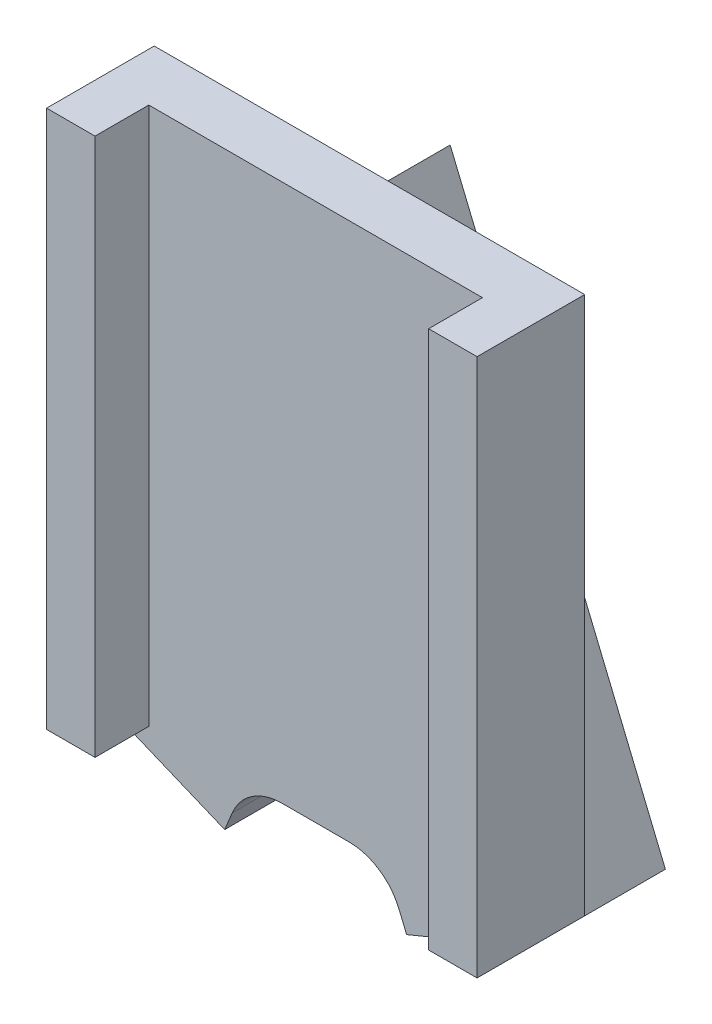
ISO-10303-21;
HEADER;
FILE_DESCRIPTION(('STEP AP214'),'2;1');
FILE_NAME('part.step','',(''),(''),'','','');
FILE_SCHEMA(('AUTOMOTIVE_DESIGN { 1 0 10303 214 1 1 1 1 }'));
ENDSEC;
DATA;
#1=APPLICATION_CONTEXT('core data for automotive mechanical design processes');
#2=APPLICATION_PROTOCOL_DEFINITION('international standard','automotive_design',2000,#1);
#3=PRODUCT_CONTEXT('',#1,'mechanical');
#4=PRODUCT('Part','Part','',(#3));
#5=PRODUCT_RELATED_PRODUCT_CATEGORY('part','',(#4));
#6=PRODUCT_DEFINITION_FORMATION('','',#4);
#7=PRODUCT_DEFINITION_CONTEXT('part definition',#1,'design');
#8=PRODUCT_DEFINITION('design','',#6,#7);
#9=PRODUCT_DEFINITION_SHAPE('','',#8);
#10=(LENGTH_UNIT() NAMED_UNIT(*) SI_UNIT(.MILLI.,.METRE.));
#11=(NAMED_UNIT(*) PLANE_ANGLE_UNIT() SI_UNIT($,.RADIAN.));
#12=(NAMED_UNIT(*) SI_UNIT($,.STERADIAN.) SOLID_ANGLE_UNIT());
#13=UNCERTAINTY_MEASURE_WITH_UNIT(LENGTH_MEASURE(1.E-05),#10,'distance_accuracy_value','');
#14=(GEOMETRIC_REPRESENTATION_CONTEXT(3) GLOBAL_UNCERTAINTY_ASSIGNED_CONTEXT((#13)) GLOBAL_UNIT_ASSIGNED_CONTEXT((#10,
#11,#12)) REPRESENTATION_CONTEXT('',''));
#15=CARTESIAN_POINT('',(0.,0.,0.));
#16=DIRECTION('',(0.,0.,1.));
#17=DIRECTION('',(1.,0.,0.));
#18=AXIS2_PLACEMENT_3D('',#15,#16,#17);
#19=CARTESIAN_POINT('',(2.30969883127822,-10.9567085809127,1.));
#20=DIRECTION('',(0.923879532511288,-0.382683432365087,0.));
#21=DIRECTION('',(0.382683432365087,0.923879532511288,0.));
#22=AXIS2_PLACEMENT_3D('',#19,#20,#21);
#23=PLANE('',#22);
#24=DIRECTION('',(0.382683432365087,0.923879532511288,0.));
#25=VECTOR('',#24,1.);
#26=CARTESIAN_POINT('',(5.84523273721094,-2.42117467497996,0.));
#27=LINE('',#26,#25);
#28=CARTESIAN_POINT('',(2.450279606139,-10.6173165676349,0.));
#29=VERTEX_POINT('',#28);
#30=CARTESIAN_POINT('',(3.71016818448233,-7.57567647471944,0.));
#31=VERTEX_POINT('',#30);
#32=EDGE_CURVE('E207',#29,#31,#27,.T.);
#33=ORIENTED_EDGE('',*,*,#32,.F.);
#34=DIRECTION('',(0.,0.,-1.));
#35=VECTOR('',#34,1.);
#36=CARTESIAN_POINT('',(2.450279606139,-10.6173165676349,1.));
#37=LINE('',#36,#35);
#38=CARTESIAN_POINT('',(2.450279606139,-10.6173165676349,1.));
#39=VERTEX_POINT('',#38);
#40=EDGE_CURVE('E296',#29,#39,#37,.F.);
#41=ORIENTED_EDGE('',*,*,#40,.T.);
#42=DIRECTION('',(-0.382683432365087,-0.923879532511288,0.));
#43=VECTOR('',#42,1.);
#44=CARTESIAN_POINT('',(2.30969883127822,-10.9567085809127,1.));
#45=LINE('',#44,#43);
#46=CARTESIAN_POINT('',(2.30969883127822,-10.9567085809127,1.));
#47=VERTEX_POINT('',#46);
#48=EDGE_CURVE('E308',#39,#47,#45,.T.);
#49=ORIENTED_EDGE('',*,*,#48,.T.);
#50=DIRECTION('',(0.,0.,-1.));
#51=VECTOR('',#50,1.);
#52=CARTESIAN_POINT('',(2.30969883127822,-10.9567085809127,1.));
#53=LINE('',#52,#51);
#54=CARTESIAN_POINT('',(2.30969883127822,-10.9567085809127,-1.5));
#55=VERTEX_POINT('',#54);
#56=EDGE_CURVE('E348',#47,#55,#53,.T.);
#57=ORIENTED_EDGE('',*,*,#56,.T.);
#58=DIRECTION('',(-0.382683432365087,-0.923879532511288,0.));
#59=VECTOR('',#58,1.);
#60=CARTESIAN_POINT('',(2.30969883127822,-10.9567085809127,-1.5));
#61=LINE('',#60,#59);
#62=CARTESIAN_POINT('',(3.71016818448233,-7.57567647471944,-1.5));
#63=VERTEX_POINT('',#62);
#64=EDGE_CURVE('E361',#63,#55,#61,.T.);
#65=ORIENTED_EDGE('',*,*,#64,.F.);
#66=DIRECTION('',(0.,0.,-1.));
#67=VECTOR('',#66,1.);
#68=CARTESIAN_POINT('',(3.71016818448233,-7.57567647471944,0.));
#69=LINE('',#68,#67);
#70=EDGE_CURVE('E198',#31,#63,#69,.T.);
#71=ORIENTED_EDGE('',*,*,#70,.F.);
#72=EDGE_LOOP('',(#33,#41,#49,#57,#65,#71));
#73=FACE_BOUND('',#72,.T.);
#74=ADVANCED_FACE('F33',(#73),#23,.T.);
#75=CARTESIAN_POINT('',(3.99999999999999,-6.8759605748895,1.));
#76=DIRECTION('',(-0.923879532511288,-0.382683432365088,0.));
#77=DIRECTION('',(0.382683432365088,-0.923879532511288,0.));
#78=AXIS2_PLACEMENT_3D('',#75,#76,#77);
#79=PLANE('',#78);
#80=DIRECTION('',(0.,0.,-1.));
#81=VECTOR('',#80,1.);
#82=CARTESIAN_POINT('',(4.01000933746841,-6.90012525315614,0.));
#83=LINE('',#82,#81);
#84=CARTESIAN_POINT('',(4.01000933746841,-6.90012525315614,0.));
#85=VERTEX_POINT('',#84);
#86=CARTESIAN_POINT('',(4.01000933746841,-6.90012525315614,-1.5));
#87=VERTEX_POINT('',#86);
#88=EDGE_CURVE('E199',#85,#87,#83,.T.);
#89=ORIENTED_EDGE('',*,*,#88,.F.);
#90=DIRECTION('',(0.382683432365088,-0.923879532511288,0.));
#91=VECTOR('',#90,1.);
#92=CARTESIAN_POINT('',(0.983194387535245,0.407252449766205,0.));
#93=LINE('',#92,#91);
#94=CARTESIAN_POINT('',(3.99999999999999,-6.8759605748895,0.));
#95=VERTEX_POINT('',#94);
#96=EDGE_CURVE('E214',#95,#85,#93,.T.);
#97=ORIENTED_EDGE('',*,*,#96,.F.);
#98=DIRECTION('',(0.,0.,-1.));
#99=VECTOR('',#98,1.);
#100=CARTESIAN_POINT('',(3.99999999999999,-6.8759605748895,1.));
#101=LINE('',#100,#99);
#102=CARTESIAN_POINT('',(3.99999999999999,-6.8759605748895,-1.5));
#103=VERTEX_POINT('',#102);
#104=EDGE_CURVE('E213',#95,#103,#101,.T.);
#105=ORIENTED_EDGE('',*,*,#104,.T.);
#106=DIRECTION('',(-0.382683432365088,0.923879532511288,0.));
#107=VECTOR('',#106,1.);
#108=CARTESIAN_POINT('',(3.99999999999999,-6.8759605748895,-1.5));
#109=LINE('',#108,#107);
#110=EDGE_CURVE('E362',#87,#103,#109,.T.);
#111=ORIENTED_EDGE('',*,*,#110,.F.);
#112=EDGE_LOOP('',(#89,#97,#105,#111));
#113=FACE_BOUND('',#112,.T.);
#114=ADVANCED_FACE('F437',(#113),#79,.T.);
#115=CARTESIAN_POINT('',(0.,-10.,2.));
#116=DIRECTION('',(0.,1.,0.));
#117=DIRECTION('',(0.,0.,1.));
#118=AXIS2_PLACEMENT_3D('',#115,#116,#117);
#119=PLANE('',#118);
#120=DIRECTION('',(1.,0.,0.));
#121=VECTOR('',#120,1.);
#122=CARTESIAN_POINT('',(0.900000000000001,-10.,1.));
#123=LINE('',#122,#121);
#124=CARTESIAN_POINT('',(3.37415913865028,-10.,1.));
#125=VERTEX_POINT('',#124);
#126=CARTESIAN_POINT('',(4.6258408613497,-10.,1.));
#127=VERTEX_POINT('',#126);
#128=EDGE_CURVE('E231',#125,#127,#123,.T.);
#129=ORIENTED_EDGE('',*,*,#128,.F.);
#130=DIRECTION('',(0.,0.,-1.));
#131=VECTOR('',#130,1.);
#132=CARTESIAN_POINT('',(3.37415913865028,-10.,2.));
#133=LINE('',#132,#131);
#134=CARTESIAN_POINT('',(3.37415913865028,-10.,0.));
#135=VERTEX_POINT('',#134);
#136=EDGE_CURVE('E293',#125,#135,#133,.T.);
#137=ORIENTED_EDGE('',*,*,#136,.T.);
#138=DIRECTION('',(1.,0.,0.));
#139=VECTOR('',#138,1.);
#140=CARTESIAN_POINT('',(0.,-10.,0.));
#141=LINE('',#140,#139);
#142=CARTESIAN_POINT('',(4.6258408613497,-10.,0.));
#143=VERTEX_POINT('',#142);
#144=EDGE_CURVE('E270',#135,#143,#141,.T.);
#145=ORIENTED_EDGE('',*,*,#144,.T.);
#146=DIRECTION('',(0.,0.,1.));
#147=VECTOR('',#146,1.);
#148=CARTESIAN_POINT('',(4.6258408613497,-10.,2.));
#149=LINE('',#148,#147);
#150=EDGE_CURVE('E290',#143,#127,#149,.T.);
#151=ORIENTED_EDGE('',*,*,#150,.T.);
#152=EDGE_LOOP('',(#129,#137,#145,#151));
#153=FACE_BOUND('',#152,.T.);
#154=ADVANCED_FACE('F313',(#153),#119,.F.);
#155=DIRECTION('',(0.,0.,-1.));
#156=VECTOR('',#155,1.);
#157=CARTESIAN_POINT('',(0.,-10.,2.));
#158=LINE('',#157,#156);
#159=CARTESIAN_POINT('',(0.,-10.,2.));
#160=VERTEX_POINT('',#159);
#161=CARTESIAN_POINT('',(0.,-10.,1.));
#162=VERTEX_POINT('',#161);
#163=EDGE_CURVE('E284',#160,#162,#158,.T.);
#164=ORIENTED_EDGE('',*,*,#163,.T.);
#165=DIRECTION('',(1.,0.,0.));
#166=VECTOR('',#165,1.);
#167=CARTESIAN_POINT('',(0.,-10.,1.));
#168=LINE('',#167,#166);
#169=CARTESIAN_POINT('',(0.900000000000001,-10.,1.));
#170=VERTEX_POINT('',#169);
#171=EDGE_CURVE('E228',#162,#170,#168,.T.);
#172=ORIENTED_EDGE('',*,*,#171,.T.);
#173=DIRECTION('',(0.,0.,1.));
#174=VECTOR('',#173,1.);
#175=CARTESIAN_POINT('',(0.900000000000001,-10.,1.));
#176=LINE('',#175,#174);
#177=CARTESIAN_POINT('',(0.900000000000001,-10.,2.));
#178=VERTEX_POINT('',#177);
#179=EDGE_CURVE('E239',#170,#178,#176,.T.);
#180=ORIENTED_EDGE('',*,*,#179,.T.);
#181=DIRECTION('',(1.,0.,0.));
#182=VECTOR('',#181,1.);
#183=CARTESIAN_POINT('',(0.,-10.,2.));
#184=LINE('',#183,#182);
#185=EDGE_CURVE('E258',#160,#178,#184,.T.);
#186=ORIENTED_EDGE('',*,*,#185,.F.);
#187=EDGE_LOOP('',(#164,#172,#180,#186));
#188=FACE_BOUND('',#187,.T.);
#189=ADVANCED_FACE('F429',(#188),#119,.F.);
#190=CARTESIAN_POINT('',(0.,0.,0.));
#191=DIRECTION('',(0.,0.,1.));
#192=DIRECTION('',(1.,0.,0.));
#193=AXIS2_PLACEMENT_3D('',#190,#191,#192);
#194=PLANE('',#193);
#195=DIRECTION('',(0.,1.,0.));
#196=VECTOR('',#195,1.);
#197=CARTESIAN_POINT('',(7.99999999999998,0.,0.));
#198=LINE('',#197,#196);
#199=CARTESIAN_POINT('',(7.99999999999998,-10.,0.));
#200=VERTEX_POINT('',#199);
#201=CARTESIAN_POINT('',(7.99999999999998,0.,0.));
#202=VERTEX_POINT('',#201);
#203=EDGE_CURVE('E273',#200,#202,#198,.T.);
#204=ORIENTED_EDGE('',*,*,#203,.F.);
#205=DIRECTION('',(-0.382683432365088,0.923879532511288,0.));
#206=VECTOR('',#205,1.);
#207=CARTESIAN_POINT('',(3.29289321881346,1.36396103067892,0.));
#208=LINE('',#207,#206);
#209=CARTESIAN_POINT('',(3.99999999999999,-0.343145750507577,0.));
#210=VERTEX_POINT('',#209);
#211=EDGE_CURVE('E222',#200,#210,#208,.T.);
#212=ORIENTED_EDGE('',*,*,#211,.T.);
#213=DIRECTION('',(-0.382683432365087,-0.923879532511288,0.));
#214=VECTOR('',#213,1.);
#215=CARTESIAN_POINT('',(3.53553390593272,-1.46446609406724,0.));
#216=LINE('',#215,#214);
#217=CARTESIAN_POINT('',(0.,-10.,0.));
#218=VERTEX_POINT('',#217);
#219=EDGE_CURVE('E216',#210,#218,#216,.T.);
#220=ORIENTED_EDGE('',*,*,#219,.T.);
#221=DIRECTION('',(0.,-1.,0.));
#222=VECTOR('',#221,1.);
#223=CARTESIAN_POINT('',(0.,0.,0.));
#224=LINE('',#223,#222);
#225=CARTESIAN_POINT('',(0.,0.,0.));
#226=VERTEX_POINT('',#225);
#227=EDGE_CURVE('E245',#226,#218,#224,.T.);
#228=ORIENTED_EDGE('',*,*,#227,.F.);
#229=DIRECTION('',(-1.,0.,0.));
#230=VECTOR('',#229,1.);
#231=CARTESIAN_POINT('',(0.,0.,0.));
#232=LINE('',#231,#230);
#233=EDGE_CURVE('E257',#202,#226,#232,.T.);
#234=ORIENTED_EDGE('',*,*,#233,.F.);
#235=EDGE_LOOP('',(#204,#212,#220,#228,#234));
#236=FACE_BOUND('',#235,.T.);
#237=ADVANCED_FACE('F395',(#236),#194,.F.);
#238=CARTESIAN_POINT('',(0.,0.,2.));
#239=DIRECTION('',(0.,0.,1.));
#240=DIRECTION('',(1.,0.,0.));
#241=AXIS2_PLACEMENT_3D('',#238,#239,#240);
#242=PLANE('',#241);
#243=DIRECTION('',(0.,-1.,0.));
#244=VECTOR('',#243,1.);
#245=CARTESIAN_POINT('',(0.9,0.,2.));
#246=LINE('',#245,#244);
#247=CARTESIAN_POINT('',(0.9,0.,2.));
#248=VERTEX_POINT('',#247);
#249=EDGE_CURVE('E240',#248,#178,#246,.T.);
#250=ORIENTED_EDGE('',*,*,#249,.F.);
#251=DIRECTION('',(-1.,0.,0.));
#252=VECTOR('',#251,1.);
#253=CARTESIAN_POINT('',(0.,0.,2.));
#254=LINE('',#253,#252);
#255=CARTESIAN_POINT('',(0.,0.,2.));
#256=VERTEX_POINT('',#255);
#257=EDGE_CURVE('E263',#248,#256,#254,.T.);
#258=ORIENTED_EDGE('',*,*,#257,.T.);
#259=DIRECTION('',(0.,-1.,0.));
#260=VECTOR('',#259,1.);
#261=CARTESIAN_POINT('',(0.,0.,2.));
#262=LINE('',#261,#260);
#263=EDGE_CURVE('E253',#256,#160,#262,.T.);
#264=ORIENTED_EDGE('',*,*,#263,.T.);
#265=ORIENTED_EDGE('',*,*,#185,.T.);
#266=EDGE_LOOP('',(#250,#258,#264,#265));
#267=FACE_BOUND('',#266,.T.);
#268=ADVANCED_FACE('F409',(#267),#242,.T.);
#269=CARTESIAN_POINT('',(0.,0.,2.));
#270=DIRECTION('',(1.,0.,0.));
#271=DIRECTION('',(0.,1.,0.));
#272=AXIS2_PLACEMENT_3D('',#269,#270,#271);
#273=PLANE('',#272);
#274=ORIENTED_EDGE('',*,*,#227,.T.);
#275=DIRECTION('',(0.,0.,-1.));
#276=VECTOR('',#275,1.);
#277=CARTESIAN_POINT('',(0.,-10.,1.));
#278=LINE('',#277,#276);
#279=EDGE_CURVE('E344',#162,#218,#278,.T.);
#280=ORIENTED_EDGE('',*,*,#279,.F.);
#281=ORIENTED_EDGE('',*,*,#163,.F.);
#282=ORIENTED_EDGE('',*,*,#263,.F.);
#283=DIRECTION('',(0.,0.,-1.));
#284=VECTOR('',#283,1.);
#285=CARTESIAN_POINT('',(0.,0.,2.));
#286=LINE('',#285,#284);
#287=EDGE_CURVE('E267',#256,#226,#286,.T.);
#288=ORIENTED_EDGE('',*,*,#287,.T.);
#289=EDGE_LOOP('',(#274,#280,#281,#282,#288));
#290=FACE_BOUND('',#289,.T.);
#291=ADVANCED_FACE('F404',(#290),#273,.F.);
#292=DIRECTION('',(0.,0.,1.));
#293=VECTOR('',#292,1.);
#294=CARTESIAN_POINT('',(7.09999999999998,-10.,1.));
#295=LINE('',#294,#293);
#296=CARTESIAN_POINT('',(7.09999999999998,-10.,1.));
#297=VERTEX_POINT('',#296);
#298=CARTESIAN_POINT('',(7.09999999999998,-10.,2.));
#299=VERTEX_POINT('',#298);
#300=EDGE_CURVE('E249',#297,#299,#295,.T.);
#301=ORIENTED_EDGE('',*,*,#300,.F.);
#302=CARTESIAN_POINT('',(7.99999999999998,-10.,1.));
#303=VERTEX_POINT('',#302);
#304=EDGE_CURVE('E225',#297,#303,#168,.T.);
#305=ORIENTED_EDGE('',*,*,#304,.T.);
#306=DIRECTION('',(0.,0.,-1.));
#307=VECTOR('',#306,1.);
#308=CARTESIAN_POINT('',(7.99999999999998,-10.,2.));
#309=LINE('',#308,#307);
#310=CARTESIAN_POINT('',(7.99999999999998,-10.,2.));
#311=VERTEX_POINT('',#310);
#312=EDGE_CURVE('E281',#311,#303,#309,.T.);
#313=ORIENTED_EDGE('',*,*,#312,.F.);
#314=EDGE_CURVE('E256',#299,#311,#184,.T.);
#315=ORIENTED_EDGE('',*,*,#314,.F.);
#316=EDGE_LOOP('',(#301,#305,#313,#315));
#317=FACE_BOUND('',#316,.T.);
#318=ADVANCED_FACE('F426',(#317),#119,.F.);
#319=CARTESIAN_POINT('',(7.99999999999998,0.,2.));
#320=DIRECTION('',(-1.,0.,0.));
#321=DIRECTION('',(0.,-1.,0.));
#322=AXIS2_PLACEMENT_3D('',#319,#320,#321);
#323=PLANE('',#322);
#324=ORIENTED_EDGE('',*,*,#203,.T.);
#325=DIRECTION('',(0.,0.,-1.));
#326=VECTOR('',#325,1.);
#327=CARTESIAN_POINT('',(7.99999999999998,0.,2.));
#328=LINE('',#327,#326);
#329=CARTESIAN_POINT('',(7.99999999999998,0.,2.));
#330=VERTEX_POINT('',#329);
#331=EDGE_CURVE('E278',#330,#202,#328,.T.);
#332=ORIENTED_EDGE('',*,*,#331,.F.);
#333=DIRECTION('',(0.,1.,0.));
#334=VECTOR('',#333,1.);
#335=CARTESIAN_POINT('',(7.99999999999998,0.,2.));
#336=LINE('',#335,#334);
#337=EDGE_CURVE('E261',#311,#330,#336,.T.);
#338=ORIENTED_EDGE('',*,*,#337,.F.);
#339=ORIENTED_EDGE('',*,*,#312,.T.);
#340=DIRECTION('',(0.,0.,-1.));
#341=VECTOR('',#340,1.);
#342=CARTESIAN_POINT('',(7.99999999999998,-10.,1.));
#343=LINE('',#342,#341);
#344=EDGE_CURVE('E338',#303,#200,#343,.T.);
#345=ORIENTED_EDGE('',*,*,#344,.T.);
#346=EDGE_LOOP('',(#324,#332,#338,#339,#345));
#347=FACE_BOUND('',#346,.T.);
#348=ADVANCED_FACE('F389',(#347),#323,.F.);
#349=CARTESIAN_POINT('',(0.,0.,2.));
#350=DIRECTION('',(0.,-1.,0.));
#351=DIRECTION('',(0.,0.,-1.));
#352=AXIS2_PLACEMENT_3D('',#349,#350,#351);
#353=PLANE('',#352);
#354=ORIENTED_EDGE('',*,*,#257,.F.);
#355=DIRECTION('',(0.,0.,1.));
#356=VECTOR('',#355,1.);
#357=CARTESIAN_POINT('',(0.9,0.,1.));
#358=LINE('',#357,#356);
#359=CARTESIAN_POINT('',(0.9,0.,1.));
#360=VERTEX_POINT('',#359);
#361=EDGE_CURVE('E243',#360,#248,#358,.T.);
#362=ORIENTED_EDGE('',*,*,#361,.F.);
#363=DIRECTION('',(-1.,0.,0.));
#364=VECTOR('',#363,1.);
#365=CARTESIAN_POINT('',(0.9,0.,1.));
#366=LINE('',#365,#364);
#367=CARTESIAN_POINT('',(7.09999999999998,0.,1.));
#368=VERTEX_POINT('',#367);
#369=EDGE_CURVE('E236',#368,#360,#366,.T.);
#370=ORIENTED_EDGE('',*,*,#369,.F.);
#371=DIRECTION('',(0.,0.,1.));
#372=VECTOR('',#371,1.);
#373=CARTESIAN_POINT('',(7.09999999999998,0.,1.));
#374=LINE('',#373,#372);
#375=CARTESIAN_POINT('',(7.09999999999998,0.,2.));
#376=VERTEX_POINT('',#375);
#377=EDGE_CURVE('E246',#368,#376,#374,.T.);
#378=ORIENTED_EDGE('',*,*,#377,.T.);
#379=EDGE_CURVE('E264',#330,#376,#254,.T.);
#380=ORIENTED_EDGE('',*,*,#379,.F.);
#381=ORIENTED_EDGE('',*,*,#331,.T.);
#382=ORIENTED_EDGE('',*,*,#233,.T.);
#383=ORIENTED_EDGE('',*,*,#287,.F.);
#384=EDGE_LOOP('',(#354,#362,#370,#378,#380,#381,#382,#383));
#385=FACE_BOUND('',#384,.T.);
#386=ADVANCED_FACE('F400',(#385),#353,.F.);
#387=DIRECTION('',(0.,1.,0.));
#388=VECTOR('',#387,1.);
#389=CARTESIAN_POINT('',(7.09999999999998,0.,2.));
#390=LINE('',#389,#388);
#391=EDGE_CURVE('E232',#299,#376,#390,.T.);
#392=ORIENTED_EDGE('',*,*,#391,.F.);
#393=ORIENTED_EDGE('',*,*,#314,.T.);
#394=ORIENTED_EDGE('',*,*,#337,.T.);
#395=ORIENTED_EDGE('',*,*,#379,.T.);
#396=EDGE_LOOP('',(#392,#393,#394,#395));
#397=FACE_BOUND('',#396,.T.);
#398=ADVANCED_FACE('F423',(#397),#242,.T.);
#399=ORIENTED_EDGE('',*,*,#32,.T.);
#400=CARTESIAN_POINT('',(3.99999999999999,-7.3,0.));
#401=DIRECTION('',(0.,0.,-1.));
#402=DIRECTION('',(-1.,0.,0.));
#403=AXIS2_PLACEMENT_3D('',#400,#401,#402);
#404=CIRCLE('',#403,0.4);
#405=CARTESIAN_POINT('',(3.98999066253156,-6.90012525315614,0.));
#406=VERTEX_POINT('',#405);
#407=EDGE_CURVE('E190',#31,#406,#404,.T.);
#408=ORIENTED_EDGE('',*,*,#407,.T.);
#409=EDGE_CURVE('E204',#406,#95,#27,.T.);
#410=ORIENTED_EDGE('',*,*,#409,.T.);
#411=ORIENTED_EDGE('',*,*,#96,.T.);
#412=CARTESIAN_POINT('',(4.28983181551765,-7.57567647471944,0.));
#413=VERTEX_POINT('',#412);
#414=EDGE_CURVE('E208',#85,#413,#404,.T.);
#415=ORIENTED_EDGE('',*,*,#414,.T.);
#416=CARTESIAN_POINT('',(5.54972039386099,-10.6173165676349,0.));
#417=VERTEX_POINT('',#416);
#418=EDGE_CURVE('E47',#413,#417,#93,.T.);
#419=ORIENTED_EDGE('',*,*,#418,.T.);
#420=CARTESIAN_POINT('',(4.6258408613497,-11.,0.));
#421=DIRECTION('',(0.,0.,1.));
#422=DIRECTION('',(1.,0.,0.));
#423=AXIS2_PLACEMENT_3D('',#420,#421,#422);
#424=CIRCLE('',#423,1.);
#425=EDGE_CURVE('E11',#417,#143,#424,.T.);
#426=ORIENTED_EDGE('',*,*,#425,.T.);
#427=ORIENTED_EDGE('',*,*,#144,.F.);
#428=CARTESIAN_POINT('',(3.37415913865028,-11.,0.));
#429=DIRECTION('',(0.,0.,1.));
#430=DIRECTION('',(1.,0.,0.));
#431=AXIS2_PLACEMENT_3D('',#428,#429,#430);
#432=CIRCLE('',#431,1.);
#433=EDGE_CURVE('E300',#135,#29,#432,.T.);
#434=ORIENTED_EDGE('',*,*,#433,.T.);
#435=EDGE_LOOP('',(#399,#408,#410,#411,#415,#419,#426,#427,#434));
#436=FACE_BOUND('',#435,.T.);
#437=ADVANCED_FACE('F202',(#436),#194,.F.);
#438=CARTESIAN_POINT('',(0.9,0.,1.));
#439=DIRECTION('',(-1.,0.,0.));
#440=DIRECTION('',(0.,-1.,0.));
#441=AXIS2_PLACEMENT_3D('',#438,#439,#440);
#442=PLANE('',#441);
#443=ORIENTED_EDGE('',*,*,#249,.T.);
#444=ORIENTED_EDGE('',*,*,#179,.F.);
#445=DIRECTION('',(0.,-1.,0.));
#446=VECTOR('',#445,1.);
#447=CARTESIAN_POINT('',(0.9,0.,1.));
#448=LINE('',#447,#446);
#449=EDGE_CURVE('E229',#360,#170,#448,.T.);
#450=ORIENTED_EDGE('',*,*,#449,.F.);
#451=ORIENTED_EDGE('',*,*,#361,.T.);
#452=EDGE_LOOP('',(#443,#444,#450,#451));
#453=FACE_BOUND('',#452,.T.);
#454=ADVANCED_FACE('F413',(#453),#442,.F.);
#455=CARTESIAN_POINT('',(7.09999999999998,0.,1.));
#456=DIRECTION('',(1.,0.,0.));
#457=DIRECTION('',(0.,1.,0.));
#458=AXIS2_PLACEMENT_3D('',#455,#456,#457);
#459=PLANE('',#458);
#460=ORIENTED_EDGE('',*,*,#391,.T.);
#461=ORIENTED_EDGE('',*,*,#377,.F.);
#462=DIRECTION('',(0.,1.,0.));
#463=VECTOR('',#462,1.);
#464=CARTESIAN_POINT('',(7.09999999999998,0.,1.));
#465=LINE('',#464,#463);
#466=EDGE_CURVE('E234',#297,#368,#465,.T.);
#467=ORIENTED_EDGE('',*,*,#466,.F.);
#468=ORIENTED_EDGE('',*,*,#300,.T.);
#469=EDGE_LOOP('',(#460,#461,#467,#468));
#470=FACE_BOUND('',#469,.T.);
#471=ADVANCED_FACE('F420',(#470),#459,.F.);
#472=CARTESIAN_POINT('',(0.,0.,1.));
#473=DIRECTION('',(0.,0.,1.));
#474=DIRECTION('',(1.,0.,0.));
#475=AXIS2_PLACEMENT_3D('',#472,#473,#474);
#476=PLANE('',#475);
#477=ORIENTED_EDGE('',*,*,#449,.T.);
#478=ORIENTED_EDGE('',*,*,#171,.F.);
#479=DIRECTION('',(-0.923879532511288,0.382683432365087,0.));
#480=VECTOR('',#479,1.);
#481=CARTESIAN_POINT('',(0.,-10.,1.));
#482=LINE('',#481,#480);
#483=EDGE_CURVE('E330',#47,#162,#482,.T.);
#484=ORIENTED_EDGE('',*,*,#483,.F.);
#485=ORIENTED_EDGE('',*,*,#48,.F.);
#486=CARTESIAN_POINT('',(3.37415913865028,-11.,1.));
#487=DIRECTION('',(0.,0.,1.));
#488=DIRECTION('',(1.,0.,0.));
#489=AXIS2_PLACEMENT_3D('',#486,#487,#488);
#490=CIRCLE('',#489,1.);
#491=EDGE_CURVE('E302',#39,#125,#490,.F.);
#492=ORIENTED_EDGE('',*,*,#491,.T.);
#493=ORIENTED_EDGE('',*,*,#128,.T.);
#494=CARTESIAN_POINT('',(4.6258408613497,-11.,1.));
#495=DIRECTION('',(0.,0.,1.));
#496=DIRECTION('',(1.,0.,0.));
#497=AXIS2_PLACEMENT_3D('',#494,#495,#496);
#498=CIRCLE('',#497,1.);
#499=CARTESIAN_POINT('',(5.54972039386099,-10.6173165676349,1.));
#500=VERTEX_POINT('',#499);
#501=EDGE_CURVE('E41',#127,#500,#498,.F.);
#502=ORIENTED_EDGE('',*,*,#501,.T.);
#503=DIRECTION('',(-0.382683432365088,0.923879532511288,0.));
#504=VECTOR('',#503,1.);
#505=CARTESIAN_POINT('',(3.99999999999999,-6.8759605748895,1.));
#506=LINE('',#505,#504);
#507=CARTESIAN_POINT('',(5.69030116872176,-10.9567085809127,1.));
#508=VERTEX_POINT('',#507);
#509=EDGE_CURVE('E323',#508,#500,#506,.T.);
#510=ORIENTED_EDGE('',*,*,#509,.F.);
#511=DIRECTION('',(-0.923879532511288,-0.382683432365088,0.));
#512=VECTOR('',#511,1.);
#513=CARTESIAN_POINT('',(7.99999999999998,-10.,1.));
#514=LINE('',#513,#512);
#515=EDGE_CURVE('E328',#303,#508,#514,.T.);
#516=ORIENTED_EDGE('',*,*,#515,.F.);
#517=ORIENTED_EDGE('',*,*,#304,.F.);
#518=ORIENTED_EDGE('',*,*,#466,.T.);
#519=ORIENTED_EDGE('',*,*,#369,.T.);
#520=EDGE_LOOP('',(#477,#478,#484,#485,#492,#493,#502,#510,#516,#517,#518,#519));
#521=FACE_BOUND('',#520,.T.);
#522=ADVANCED_FACE('F306',(#521),#476,.T.);
#523=CARTESIAN_POINT('',(7.99999999999998,-10.,1.));
#524=DIRECTION('',(0.923879532511288,0.382683432365088,0.));
#525=DIRECTION('',(-0.382683432365088,0.923879532511288,0.));
#526=AXIS2_PLACEMENT_3D('',#523,#524,#525);
#527=PLANE('',#526);
#528=ORIENTED_EDGE('',*,*,#211,.F.);
#529=CARTESIAN_POINT('',(7.99999999999998,-10.,-1.5));
#530=VERTEX_POINT('',#529);
#531=EDGE_CURVE('E341',#200,#530,#343,.T.);
#532=ORIENTED_EDGE('',*,*,#531,.T.);
#533=DIRECTION('',(0.382683432365088,-0.923879532511288,0.));
#534=VECTOR('',#533,1.);
#535=CARTESIAN_POINT('',(7.99999999999998,-10.,-1.5));
#536=LINE('',#535,#534);
#537=CARTESIAN_POINT('',(3.99999999999999,-0.343145750507577,-1.5));
#538=VERTEX_POINT('',#537);
#539=EDGE_CURVE('E332',#538,#530,#536,.T.);
#540=ORIENTED_EDGE('',*,*,#539,.F.);
#541=DIRECTION('',(0.,0.,-1.));
#542=VECTOR('',#541,1.);
#543=CARTESIAN_POINT('',(3.99999999999999,-0.343145750507577,1.));
#544=LINE('',#543,#542);
#545=EDGE_CURVE('E342',#210,#538,#544,.T.);
#546=ORIENTED_EDGE('',*,*,#545,.F.);
#547=EDGE_LOOP('',(#528,#532,#540,#546));
#548=FACE_BOUND('',#547,.T.);
#549=ADVANCED_FACE('F386',(#548),#527,.T.);
#550=CARTESIAN_POINT('',(0.,-10.,1.));
#551=DIRECTION('',(-0.923879532511288,0.382683432365087,0.));
#552=DIRECTION('',(-0.382683432365087,-0.923879532511288,0.));
#553=AXIS2_PLACEMENT_3D('',#550,#551,#552);
#554=PLANE('',#553);
#555=ORIENTED_EDGE('',*,*,#219,.F.);
#556=ORIENTED_EDGE('',*,*,#545,.T.);
#557=DIRECTION('',(0.382683432365087,0.923879532511288,0.));
#558=VECTOR('',#557,1.);
#559=CARTESIAN_POINT('',(0.,-10.,-1.5));
#560=LINE('',#559,#558);
#561=CARTESIAN_POINT('',(0.,-10.,-1.5));
#562=VERTEX_POINT('',#561);
#563=EDGE_CURVE('E380',#562,#538,#560,.T.);
#564=ORIENTED_EDGE('',*,*,#563,.F.);
#565=EDGE_CURVE('E347',#218,#562,#278,.T.);
#566=ORIENTED_EDGE('',*,*,#565,.F.);
#567=EDGE_LOOP('',(#555,#556,#564,#566));
#568=FACE_BOUND('',#567,.T.);
#569=ADVANCED_FACE('F450',(#568),#554,.T.);
#570=DIRECTION('',(0.,0.,-1.));
#571=VECTOR('',#570,1.);
#572=CARTESIAN_POINT('',(3.98999066253156,-6.90012525315614,0.));
#573=LINE('',#572,#571);
#574=CARTESIAN_POINT('',(3.98999066253156,-6.90012525315614,-1.5));
#575=VERTEX_POINT('',#574);
#576=EDGE_CURVE('E187',#575,#406,#573,.F.);
#577=ORIENTED_EDGE('',*,*,#576,.F.);
#578=EDGE_CURVE('E375',#103,#575,#61,.T.);
#579=ORIENTED_EDGE('',*,*,#578,.F.);
#580=ORIENTED_EDGE('',*,*,#104,.F.);
#581=ORIENTED_EDGE('',*,*,#409,.F.);
#582=EDGE_LOOP('',(#577,#579,#580,#581));
#583=FACE_BOUND('',#582,.T.);
#584=ADVANCED_FACE('F211',(#583),#23,.T.);
#585=ORIENTED_EDGE('',*,*,#509,.T.);
#586=DIRECTION('',(0.,0.,1.));
#587=VECTOR('',#586,1.);
#588=CARTESIAN_POINT('',(5.54972039386099,-10.6173165676349,1.));
#589=LINE('',#588,#587);
#590=EDGE_CURVE('E298',#500,#417,#589,.F.);
#591=ORIENTED_EDGE('',*,*,#590,.T.);
#592=ORIENTED_EDGE('',*,*,#418,.F.);
#593=DIRECTION('',(0.,0.,-1.));
#594=VECTOR('',#593,1.);
#595=CARTESIAN_POINT('',(4.28983181551765,-7.57567647471944,0.));
#596=LINE('',#595,#594);
#597=CARTESIAN_POINT('',(4.28983181551765,-7.57567647471944,-1.5));
#598=VERTEX_POINT('',#597);
#599=EDGE_CURVE('E359',#598,#413,#596,.F.);
#600=ORIENTED_EDGE('',*,*,#599,.F.);
#601=CARTESIAN_POINT('',(5.69030116872176,-10.9567085809127,-1.5));
#602=VERTEX_POINT('',#601);
#603=EDGE_CURVE('E358',#602,#598,#109,.T.);
#604=ORIENTED_EDGE('',*,*,#603,.F.);
#605=DIRECTION('',(0.,0.,-1.));
#606=VECTOR('',#605,1.);
#607=CARTESIAN_POINT('',(5.69030116872176,-10.9567085809127,1.));
#608=LINE('',#607,#606);
#609=EDGE_CURVE('E325',#508,#602,#608,.T.);
#610=ORIENTED_EDGE('',*,*,#609,.F.);
#611=EDGE_LOOP('',(#585,#591,#592,#600,#604,#610));
#612=FACE_BOUND('',#611,.T.);
#613=ADVANCED_FACE('F321',(#612),#79,.T.);
#614=CARTESIAN_POINT('',(7.99999999999998,-10.,1.));
#615=DIRECTION('',(0.382683432365088,-0.923879532511288,0.));
#616=DIRECTION('',(0.923879532511288,0.382683432365088,0.));
#617=AXIS2_PLACEMENT_3D('',#614,#615,#616);
#618=PLANE('',#617);
#619=CARTESIAN_POINT('',(6.84515058436087,-10.4783542904564,-0.25));
#620=DIRECTION('',(0.382683432365088,-0.923879532511288,0.));
#621=DIRECTION('',(0.923879532511288,0.382683432365088,0.));
#622=AXIS2_PLACEMENT_3D('',#619,#620,#621);
#623=CIRCLE('',#622,0.499999999999999);
#624=CARTESIAN_POINT('',(7.30709035061652,-10.2870125742738,-0.25));
#625=VERTEX_POINT('',#624);
#626=EDGE_CURVE('E476',#625,#625,#623,.T.);
#627=ORIENTED_EDGE('',*,*,#626,.F.);
#628=EDGE_LOOP('',(#627));
#629=FACE_BOUND('',#628,.T.);
#630=ORIENTED_EDGE('',*,*,#609,.T.);
#631=DIRECTION('',(-0.923879532511288,-0.382683432365088,0.));
#632=VECTOR('',#631,1.);
#633=CARTESIAN_POINT('',(7.99999999999998,-10.,-1.5));
#634=LINE('',#633,#632);
#635=EDGE_CURVE('E356',#530,#602,#634,.T.);
#636=ORIENTED_EDGE('',*,*,#635,.F.);
#637=ORIENTED_EDGE('',*,*,#531,.F.);
#638=ORIENTED_EDGE('',*,*,#344,.F.);
#639=ORIENTED_EDGE('',*,*,#515,.T.);
#640=EDGE_LOOP('',(#630,#636,#637,#638,#639));
#641=FACE_BOUND('',#640,.T.);
#642=ADVANCED_FACE('F353',(#629,#641),#618,.T.);
#643=CARTESIAN_POINT('',(0.,-10.,1.));
#644=DIRECTION('',(-0.382683432365087,-0.923879532511288,0.));
#645=DIRECTION('',(0.923879532511288,-0.382683432365087,0.));
#646=AXIS2_PLACEMENT_3D('',#643,#644,#645);
#647=PLANE('',#646);
#648=CARTESIAN_POINT('',(1.19102862325463,-10.4933402089266,-0.25));
#649=DIRECTION('',(-0.382683432365087,-0.923879532511288,0.));
#650=DIRECTION('',(0.923879532511288,-0.382683432365087,0.));
#651=AXIS2_PLACEMENT_3D('',#648,#649,#650);
#652=CIRCLE('',#651,0.599999999999999);
#653=CARTESIAN_POINT('',(1.7453563427614,-10.7229502683457,-0.25));
#654=VERTEX_POINT('',#653);
#655=EDGE_CURVE('E371',#654,#654,#652,.T.);
#656=ORIENTED_EDGE('',*,*,#655,.F.);
#657=EDGE_LOOP('',(#656));
#658=FACE_BOUND('',#657,.T.);
#659=ORIENTED_EDGE('',*,*,#279,.T.);
#660=ORIENTED_EDGE('',*,*,#565,.T.);
#661=DIRECTION('',(-0.923879532511288,0.382683432365087,0.));
#662=VECTOR('',#661,1.);
#663=CARTESIAN_POINT('',(0.,-10.,-1.5));
#664=LINE('',#663,#662);
#665=EDGE_CURVE('E377',#55,#562,#664,.T.);
#666=ORIENTED_EDGE('',*,*,#665,.F.);
#667=ORIENTED_EDGE('',*,*,#56,.F.);
#668=ORIENTED_EDGE('',*,*,#483,.T.);
#669=EDGE_LOOP('',(#659,#660,#666,#667,#668));
#670=FACE_BOUND('',#669,.T.);
#671=ADVANCED_FACE('F461',(#658,#670),#647,.T.);
#672=CARTESIAN_POINT('',(0.,0.,-1.5));
#673=DIRECTION('',(0.,0.,1.));
#674=DIRECTION('',(1.,0.,0.));
#675=AXIS2_PLACEMENT_3D('',#672,#673,#674);
#676=PLANE('',#675);
#677=ORIENTED_EDGE('',*,*,#578,.T.);
#678=CARTESIAN_POINT('',(3.99999999999999,-7.3,-1.5));
#679=DIRECTION('',(0.,0.,1.));
#680=DIRECTION('',(1.,0.,0.));
#681=AXIS2_PLACEMENT_3D('',#678,#679,#680);
#682=CIRCLE('',#681,0.4);
#683=EDGE_CURVE('E193',#575,#63,#682,.T.);
#684=ORIENTED_EDGE('',*,*,#683,.T.);
#685=ORIENTED_EDGE('',*,*,#64,.T.);
#686=ORIENTED_EDGE('',*,*,#665,.T.);
#687=ORIENTED_EDGE('',*,*,#563,.T.);
#688=ORIENTED_EDGE('',*,*,#539,.T.);
#689=ORIENTED_EDGE('',*,*,#635,.T.);
#690=ORIENTED_EDGE('',*,*,#603,.T.);
#691=EDGE_CURVE('E287',#598,#87,#682,.T.);
#692=ORIENTED_EDGE('',*,*,#691,.T.);
#693=ORIENTED_EDGE('',*,*,#110,.T.);
#694=EDGE_LOOP('',(#677,#684,#685,#686,#687,#688,#689,#690,#692,#693));
#695=FACE_BOUND('',#694,.T.);
#696=ADVANCED_FACE('F365',(#695),#676,.F.);
#697=CARTESIAN_POINT('',(3.10444578508007,-5.87394254637019,-0.25));
#698=DIRECTION('',(-0.382683432365087,-0.923879532511288,0.));
#699=DIRECTION('',(0.923879532511288,-0.382683432365087,0.));
#700=AXIS2_PLACEMENT_3D('',#697,#698,#699);
#701=CONICAL_SURFACE('',#700,0.599999999999999,1.02974425867665);
#702=CARTESIAN_POINT('',(3.24240942751756,-5.54086884968321,-0.250000000000001));
#703=VERTEX_POINT('',#702);
#704=VERTEX_LOOP('',#703);
#705=FACE_BOUND('',#704,.T.);
#706=CARTESIAN_POINT('',(3.10444578508007,-5.87394254637019,-0.25));
#707=DIRECTION('',(-0.382683432365087,-0.923879532511288,0.));
#708=DIRECTION('',(0.923879532511288,-0.382683432365087,0.));
#709=AXIS2_PLACEMENT_3D('',#706,#707,#708);
#710=CIRCLE('',#709,0.599999999999999);
#711=CARTESIAN_POINT('',(3.65877350458684,-6.10355260578924,-0.25));
#712=VERTEX_POINT('',#711);
#713=EDGE_CURVE('E368',#712,#712,#710,.T.);
#714=ORIENTED_EDGE('',*,*,#713,.T.);
#715=EDGE_LOOP('',(#714));
#716=FACE_BOUND('',#715,.T.);
#717=ADVANCED_FACE('F468',(#705,#716),#701,.F.);
#718=CARTESIAN_POINT('',(1.19102862325463,-10.4933402089266,-0.25));
#719=DIRECTION('',(-0.382683432365087,-0.923879532511288,0.));
#720=DIRECTION('',(0.923879532511288,-0.382683432365087,0.));
#721=AXIS2_PLACEMENT_3D('',#718,#719,#720);
#722=CYLINDRICAL_SURFACE('',#721,0.599999999999999);
#723=ORIENTED_EDGE('',*,*,#713,.F.);
#724=EDGE_LOOP('',(#723));
#725=FACE_BOUND('',#724,.T.);
#726=ORIENTED_EDGE('',*,*,#655,.T.);
#727=EDGE_LOOP('',(#726));
#728=FACE_BOUND('',#727,.T.);
#729=ADVANCED_FACE('F485',(#725,#728),#722,.F.);
#730=CARTESIAN_POINT('',(4.93173342253543,-5.85895662789992,-0.25));
#731=DIRECTION('',(0.382683432365088,-0.923879532511288,0.));
#732=DIRECTION('',(0.923879532511288,0.382683432365088,0.));
#733=AXIS2_PLACEMENT_3D('',#730,#731,#732);
#734=CONICAL_SURFACE('',#733,0.499999999999999,1.02974425867665);
#735=CARTESIAN_POINT('',(4.81676372050419,-5.58139521399411,-0.250000000000001));
#736=VERTEX_POINT('',#735);
#737=VERTEX_LOOP('',#736);
#738=FACE_BOUND('',#737,.T.);
#739=CARTESIAN_POINT('',(4.93173342253543,-5.85895662789992,-0.25));
#740=DIRECTION('',(0.382683432365088,-0.923879532511288,0.));
#741=DIRECTION('',(0.923879532511288,0.382683432365088,0.));
#742=AXIS2_PLACEMENT_3D('',#739,#740,#741);
#743=CIRCLE('',#742,0.499999999999999);
#744=CARTESIAN_POINT('',(5.39367318879107,-5.66761491171738,-0.25));
#745=VERTEX_POINT('',#744);
#746=EDGE_CURVE('E479',#745,#745,#743,.T.);
#747=ORIENTED_EDGE('',*,*,#746,.T.);
#748=EDGE_LOOP('',(#747));
#749=FACE_BOUND('',#748,.T.);
#750=ADVANCED_FACE('F487',(#738,#749),#734,.F.);
#751=CARTESIAN_POINT('',(6.84515058436087,-10.4783542904564,-0.25));
#752=DIRECTION('',(0.382683432365088,-0.923879532511288,0.));
#753=DIRECTION('',(0.923879532511288,0.382683432365088,0.));
#754=AXIS2_PLACEMENT_3D('',#751,#752,#753);
#755=CYLINDRICAL_SURFACE('',#754,0.499999999999999);
#756=ORIENTED_EDGE('',*,*,#746,.F.);
#757=EDGE_LOOP('',(#756));
#758=FACE_BOUND('',#757,.T.);
#759=ORIENTED_EDGE('',*,*,#626,.T.);
#760=EDGE_LOOP('',(#759));
#761=FACE_BOUND('',#760,.T.);
#762=ADVANCED_FACE('F494',(#758,#761),#755,.F.);
#763=CARTESIAN_POINT('',(3.99999999999999,-7.3,0.));
#764=DIRECTION('',(0.,0.,-1.));
#765=DIRECTION('',(-1.,0.,0.));
#766=AXIS2_PLACEMENT_3D('',#763,#764,#765);
#767=CYLINDRICAL_SURFACE('',#766,0.4);
#768=ORIENTED_EDGE('',*,*,#88,.T.);
#769=ORIENTED_EDGE('',*,*,#691,.F.);
#770=ORIENTED_EDGE('',*,*,#599,.T.);
#771=ORIENTED_EDGE('',*,*,#414,.F.);
#772=EDGE_LOOP('',(#768,#769,#770,#771));
#773=FACE_BOUND('',#772,.T.);
#774=ADVANCED_FACE('F503',(#773),#767,.F.);
#775=ORIENTED_EDGE('',*,*,#70,.T.);
#776=ORIENTED_EDGE('',*,*,#683,.F.);
#777=ORIENTED_EDGE('',*,*,#576,.T.);
#778=ORIENTED_EDGE('',*,*,#407,.F.);
#779=EDGE_LOOP('',(#775,#776,#777,#778));
#780=FACE_BOUND('',#779,.T.);
#781=ADVANCED_FACE('F189',(#780),#767,.F.);
#782=CARTESIAN_POINT('',(3.37415913865028,-11.,2.));
#783=DIRECTION('',(0.,0.,-1.));
#784=DIRECTION('',(-1.,0.,0.));
#785=AXIS2_PLACEMENT_3D('',#782,#783,#784);
#786=CYLINDRICAL_SURFACE('',#785,1.);
#787=ORIENTED_EDGE('',*,*,#491,.F.);
#788=ORIENTED_EDGE('',*,*,#40,.F.);
#789=ORIENTED_EDGE('',*,*,#433,.F.);
#790=ORIENTED_EDGE('',*,*,#136,.F.);
#791=EDGE_LOOP('',(#787,#788,#789,#790));
#792=FACE_BOUND('',#791,.T.);
#793=ADVANCED_FACE('F316',(#792),#786,.F.);
#794=CARTESIAN_POINT('',(4.6258408613497,-11.,2.));
#795=DIRECTION('',(0.,0.,1.));
#796=DIRECTION('',(1.,0.,0.));
#797=AXIS2_PLACEMENT_3D('',#794,#795,#796);
#798=CYLINDRICAL_SURFACE('',#797,1.);
#799=ORIENTED_EDGE('',*,*,#425,.F.);
#800=ORIENTED_EDGE('',*,*,#590,.F.);
#801=ORIENTED_EDGE('',*,*,#501,.F.);
#802=ORIENTED_EDGE('',*,*,#150,.F.);
#803=EDGE_LOOP('',(#799,#800,#801,#802));
#804=FACE_BOUND('',#803,.T.);
#805=ADVANCED_FACE('F35',(#804),#798,.F.);
#806=CLOSED_SHELL('',(#74,#114,#154,#189,#237,#268,#291,#318,#348,#386,#398,#437,#454,#471,#522,
#549,#569,#584,#613,#642,#671,#696,#717,#729,#750,#762,#774,#781,#793,#805));
#807=MANIFOLD_SOLID_BREP('B2',#806);
#808=ADVANCED_BREP_SHAPE_REPRESENTATION('',(#18,#807),#14);
#809=SHAPE_DEFINITION_REPRESENTATION(#9,#808);
ENDSEC;
END-ISO-10303-21;
